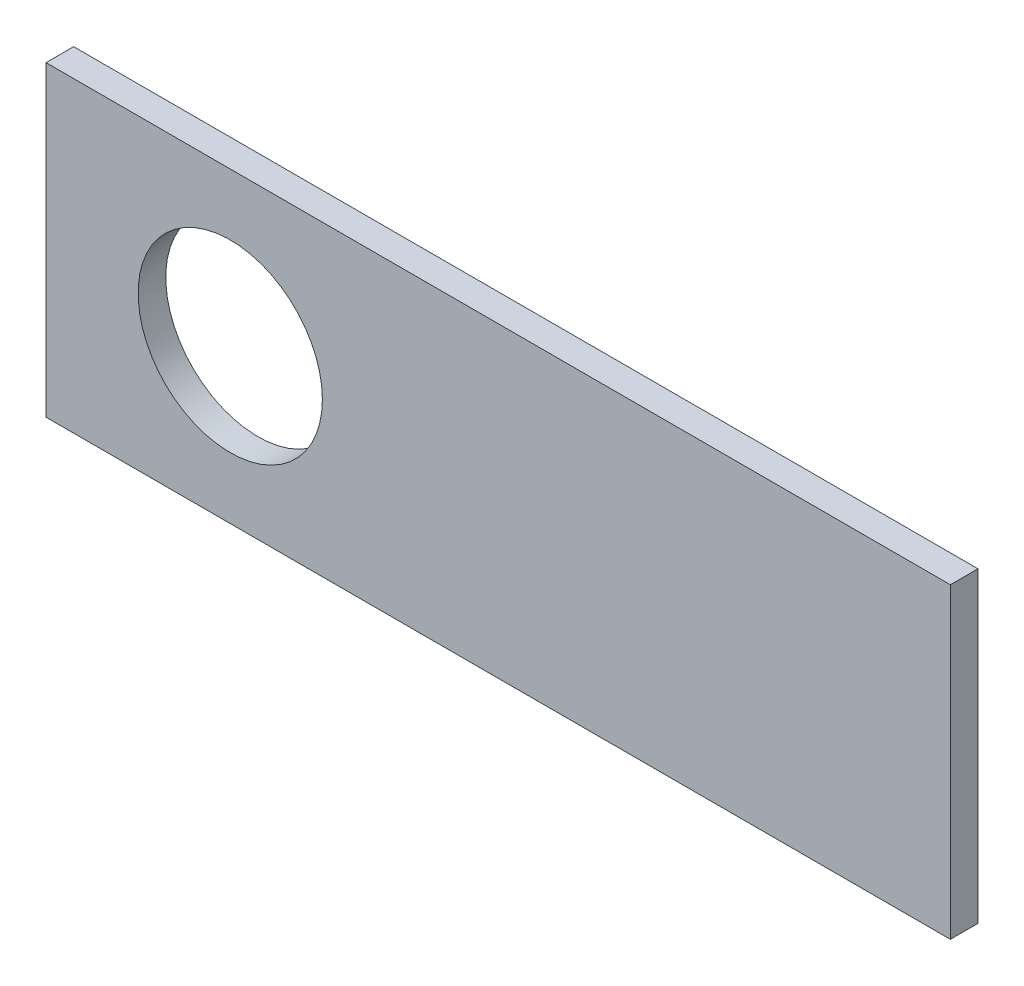
ISO-10303-21;
HEADER;
FILE_DESCRIPTION(('STEP AP214'),'2;1');
FILE_NAME('part.step','',(''),(''),'','','');
FILE_SCHEMA(('AUTOMOTIVE_DESIGN { 1 0 10303 214 1 1 1 1 }'));
ENDSEC;
DATA;
#1=APPLICATION_CONTEXT('core data for automotive mechanical design processes');
#2=APPLICATION_PROTOCOL_DEFINITION('international standard','automotive_design',2000,#1);
#3=PRODUCT_CONTEXT('',#1,'mechanical');
#4=PRODUCT('Part','Part','',(#3));
#5=PRODUCT_RELATED_PRODUCT_CATEGORY('part','',(#4));
#6=PRODUCT_DEFINITION_FORMATION('','',#4);
#7=PRODUCT_DEFINITION_CONTEXT('part definition',#1,'design');
#8=PRODUCT_DEFINITION('design','',#6,#7);
#9=PRODUCT_DEFINITION_SHAPE('','',#8);
#10=(LENGTH_UNIT() NAMED_UNIT(*) SI_UNIT(.MILLI.,.METRE.));
#11=(NAMED_UNIT(*) PLANE_ANGLE_UNIT() SI_UNIT($,.RADIAN.));
#12=(NAMED_UNIT(*) SI_UNIT($,.STERADIAN.) SOLID_ANGLE_UNIT());
#13=UNCERTAINTY_MEASURE_WITH_UNIT(LENGTH_MEASURE(1.E-05),#10,'distance_accuracy_value','');
#14=(GEOMETRIC_REPRESENTATION_CONTEXT(3) GLOBAL_UNCERTAINTY_ASSIGNED_CONTEXT((#13)) GLOBAL_UNIT_ASSIGNED_CONTEXT((#10,
#11,#12)) REPRESENTATION_CONTEXT('',''));
#15=CARTESIAN_POINT('',(0.,0.,0.));
#16=DIRECTION('',(0.,0.,1.));
#17=DIRECTION('',(1.,0.,0.));
#18=AXIS2_PLACEMENT_3D('',#15,#16,#17);
#19=CARTESIAN_POINT('',(-294.5,-100.,18.));
#20=DIRECTION('',(1.,0.,0.));
#21=DIRECTION('',(0.,0.,-1.));
#22=AXIS2_PLACEMENT_3D('',#19,#20,#21);
#23=PLANE('',#22);
#24=DIRECTION('',(0.,-1.,0.));
#25=VECTOR('',#24,1.);
#26=CARTESIAN_POINT('',(-294.5,-100.,0.));
#27=LINE('',#26,#25);
#28=CARTESIAN_POINT('',(-294.5,100.,0.));
#29=VERTEX_POINT('',#28);
#30=CARTESIAN_POINT('',(-294.5,-100.,0.));
#31=VERTEX_POINT('',#30);
#32=EDGE_CURVE('E98',#29,#31,#27,.T.);
#33=ORIENTED_EDGE('',*,*,#32,.T.);
#34=DIRECTION('',(0.,0.,-1.));
#35=VECTOR('',#34,1.);
#36=CARTESIAN_POINT('',(-294.5,-100.,18.));
#37=LINE('',#36,#35);
#38=CARTESIAN_POINT('',(-294.5,-100.,18.));
#39=VERTEX_POINT('',#38);
#40=EDGE_CURVE('E11',#39,#31,#37,.T.);
#41=ORIENTED_EDGE('',*,*,#40,.F.);
#42=DIRECTION('',(0.,-1.,0.));
#43=VECTOR('',#42,1.);
#44=CARTESIAN_POINT('',(-294.5,-100.,18.));
#45=LINE('',#44,#43);
#46=CARTESIAN_POINT('',(-294.5,100.,18.));
#47=VERTEX_POINT('',#46);
#48=EDGE_CURVE('E86',#47,#39,#45,.T.);
#49=ORIENTED_EDGE('',*,*,#48,.F.);
#50=DIRECTION('',(0.,0.,-1.));
#51=VECTOR('',#50,1.);
#52=CARTESIAN_POINT('',(-294.5,100.,18.));
#53=LINE('',#52,#51);
#54=EDGE_CURVE('E94',#47,#29,#53,.T.);
#55=ORIENTED_EDGE('',*,*,#54,.T.);
#56=EDGE_LOOP('',(#33,#41,#49,#55));
#57=FACE_BOUND('',#56,.T.);
#58=ADVANCED_FACE('F35',(#57),#23,.F.);
#59=CARTESIAN_POINT('',(294.5,-99.9999999999999,18.));
#60=DIRECTION('',(0.,1.,0.));
#61=DIRECTION('',(-1.,0.,0.));
#62=AXIS2_PLACEMENT_3D('',#59,#60,#61);
#63=PLANE('',#62);
#64=DIRECTION('',(1.,0.,0.));
#65=VECTOR('',#64,1.);
#66=CARTESIAN_POINT('',(294.5,-99.9999999999999,0.));
#67=LINE('',#66,#65);
#68=CARTESIAN_POINT('',(294.5,-99.9999999999999,0.));
#69=VERTEX_POINT('',#68);
#70=EDGE_CURVE('E90',#31,#69,#67,.T.);
#71=ORIENTED_EDGE('',*,*,#70,.T.);
#72=DIRECTION('',(0.,0.,-1.));
#73=VECTOR('',#72,1.);
#74=CARTESIAN_POINT('',(294.5,-99.9999999999999,18.));
#75=LINE('',#74,#73);
#76=CARTESIAN_POINT('',(294.5,-99.9999999999999,18.));
#77=VERTEX_POINT('',#76);
#78=EDGE_CURVE('E43',#77,#69,#75,.T.);
#79=ORIENTED_EDGE('',*,*,#78,.F.);
#80=DIRECTION('',(1.,0.,0.));
#81=VECTOR('',#80,1.);
#82=CARTESIAN_POINT('',(294.5,-99.9999999999999,18.));
#83=LINE('',#82,#81);
#84=EDGE_CURVE('E81',#39,#77,#83,.T.);
#85=ORIENTED_EDGE('',*,*,#84,.F.);
#86=ORIENTED_EDGE('',*,*,#40,.T.);
#87=EDGE_LOOP('',(#71,#79,#85,#86));
#88=FACE_BOUND('',#87,.T.);
#89=ADVANCED_FACE('F89',(#88),#63,.F.);
#90=CARTESIAN_POINT('',(294.5,-99.9999999999999,18.));
#91=DIRECTION('',(-1.,0.,0.));
#92=DIRECTION('',(0.,0.,1.));
#93=AXIS2_PLACEMENT_3D('',#90,#91,#92);
#94=PLANE('',#93);
#95=DIRECTION('',(0.,1.,0.));
#96=VECTOR('',#95,1.);
#97=CARTESIAN_POINT('',(294.5,-99.9999999999999,0.));
#98=LINE('',#97,#96);
#99=CARTESIAN_POINT('',(294.5,100.,0.));
#100=VERTEX_POINT('',#99);
#101=EDGE_CURVE('E68',#69,#100,#98,.T.);
#102=ORIENTED_EDGE('',*,*,#101,.T.);
#103=DIRECTION('',(0.,0.,-1.));
#104=VECTOR('',#103,1.);
#105=CARTESIAN_POINT('',(294.5,100.,18.));
#106=LINE('',#105,#104);
#107=CARTESIAN_POINT('',(294.5,100.,18.));
#108=VERTEX_POINT('',#107);
#109=EDGE_CURVE('E91',#108,#100,#106,.T.);
#110=ORIENTED_EDGE('',*,*,#109,.F.);
#111=DIRECTION('',(0.,1.,0.));
#112=VECTOR('',#111,1.);
#113=CARTESIAN_POINT('',(294.5,-99.9999999999999,18.));
#114=LINE('',#113,#112);
#115=EDGE_CURVE('E84',#77,#108,#114,.T.);
#116=ORIENTED_EDGE('',*,*,#115,.F.);
#117=ORIENTED_EDGE('',*,*,#78,.T.);
#118=EDGE_LOOP('',(#102,#110,#116,#117));
#119=FACE_BOUND('',#118,.T.);
#120=ADVANCED_FACE('F92',(#119),#94,.F.);
#121=CARTESIAN_POINT('',(294.5,100.,18.));
#122=DIRECTION('',(0.,-1.,0.));
#123=DIRECTION('',(1.,0.,0.));
#124=AXIS2_PLACEMENT_3D('',#121,#122,#123);
#125=PLANE('',#124);
#126=DIRECTION('',(-1.,0.,0.));
#127=VECTOR('',#126,1.);
#128=CARTESIAN_POINT('',(294.5,100.,0.));
#129=LINE('',#128,#127);
#130=EDGE_CURVE('E74',#100,#29,#129,.T.);
#131=ORIENTED_EDGE('',*,*,#130,.T.);
#132=ORIENTED_EDGE('',*,*,#54,.F.);
#133=DIRECTION('',(-1.,0.,0.));
#134=VECTOR('',#133,1.);
#135=CARTESIAN_POINT('',(294.5,100.,18.));
#136=LINE('',#135,#134);
#137=EDGE_CURVE('E51',#108,#47,#136,.T.);
#138=ORIENTED_EDGE('',*,*,#137,.F.);
#139=ORIENTED_EDGE('',*,*,#109,.T.);
#140=EDGE_LOOP('',(#131,#132,#138,#139));
#141=FACE_BOUND('',#140,.T.);
#142=ADVANCED_FACE('F106',(#141),#125,.F.);
#143=CARTESIAN_POINT('',(0.,0.,18.));
#144=DIRECTION('',(0.,0.,1.));
#145=DIRECTION('',(1.,0.,0.));
#146=AXIS2_PLACEMENT_3D('',#143,#144,#145);
#147=PLANE('',#146);
#148=CARTESIAN_POINT('',(-174.5,0.,18.));
#149=DIRECTION('',(0.,0.,1.));
#150=DIRECTION('',(1.,0.,0.));
#151=AXIS2_PLACEMENT_3D('',#148,#149,#150);
#152=CIRCLE('',#151,60.);
#153=CARTESIAN_POINT('',(-114.5,0.,18.));
#154=VERTEX_POINT('',#153);
#155=EDGE_CURVE('E112',#154,#154,#152,.T.);
#156=ORIENTED_EDGE('',*,*,#155,.F.);
#157=EDGE_LOOP('',(#156));
#158=FACE_BOUND('',#157,.T.);
#159=ORIENTED_EDGE('',*,*,#48,.T.);
#160=ORIENTED_EDGE('',*,*,#84,.T.);
#161=ORIENTED_EDGE('',*,*,#115,.T.);
#162=ORIENTED_EDGE('',*,*,#137,.T.);
#163=EDGE_LOOP('',(#159,#160,#161,#162));
#164=FACE_BOUND('',#163,.T.);
#165=ADVANCED_FACE('F82',(#158,#164),#147,.T.);
#166=CARTESIAN_POINT('',(0.,0.,0.));
#167=DIRECTION('',(0.,0.,1.));
#168=DIRECTION('',(1.,0.,0.));
#169=AXIS2_PLACEMENT_3D('',#166,#167,#168);
#170=PLANE('',#169);
#171=CARTESIAN_POINT('',(-174.5,0.,0.));
#172=DIRECTION('',(0.,0.,1.));
#173=DIRECTION('',(1.,0.,0.));
#174=AXIS2_PLACEMENT_3D('',#171,#172,#173);
#175=CIRCLE('',#174,60.);
#176=CARTESIAN_POINT('',(-114.5,0.,0.));
#177=VERTEX_POINT('',#176);
#178=EDGE_CURVE('E101',#177,#177,#175,.T.);
#179=ORIENTED_EDGE('',*,*,#178,.T.);
#180=EDGE_LOOP('',(#179));
#181=FACE_BOUND('',#180,.T.);
#182=ORIENTED_EDGE('',*,*,#32,.F.);
#183=ORIENTED_EDGE('',*,*,#130,.F.);
#184=ORIENTED_EDGE('',*,*,#101,.F.);
#185=ORIENTED_EDGE('',*,*,#70,.F.);
#186=EDGE_LOOP('',(#182,#183,#184,#185));
#187=FACE_BOUND('',#186,.T.);
#188=ADVANCED_FACE('F109',(#181,#187),#170,.F.);
#189=CARTESIAN_POINT('',(-174.5,0.,0.));
#190=DIRECTION('',(0.,0.,1.));
#191=DIRECTION('',(1.,0.,0.));
#192=AXIS2_PLACEMENT_3D('',#189,#190,#191);
#193=CYLINDRICAL_SURFACE('',#192,60.);
#194=ORIENTED_EDGE('',*,*,#178,.F.);
#195=EDGE_LOOP('',(#194));
#196=FACE_BOUND('',#195,.T.);
#197=ORIENTED_EDGE('',*,*,#155,.T.);
#198=EDGE_LOOP('',(#197));
#199=FACE_BOUND('',#198,.T.);
#200=ADVANCED_FACE('F119',(#196,#199),#193,.F.);
#201=CLOSED_SHELL('',(#58,#89,#120,#142,#165,#188,#200));
#202=MANIFOLD_SOLID_BREP('B2',#201);
#203=ADVANCED_BREP_SHAPE_REPRESENTATION('',(#18,#202),#14);
#204=SHAPE_DEFINITION_REPRESENTATION(#9,#203);
ENDSEC;
END-ISO-10303-21;
